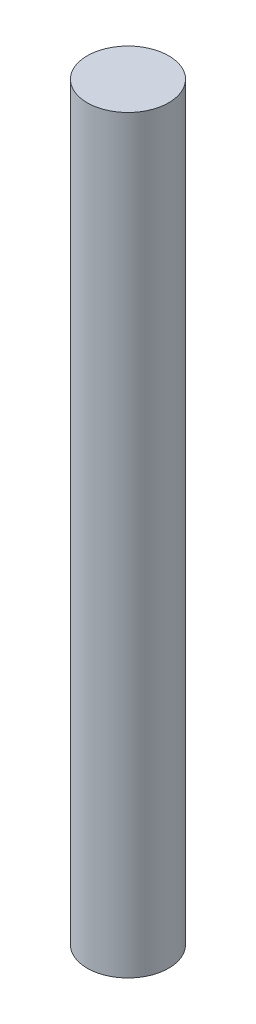
ISO-10303-21;
HEADER;
FILE_DESCRIPTION(('STEP AP214'),'2;1');
FILE_NAME('part.step','',(''),(''),'','','');
FILE_SCHEMA(('AUTOMOTIVE_DESIGN { 1 0 10303 214 1 1 1 1 }'));
ENDSEC;
DATA;
#1=APPLICATION_CONTEXT('core data for automotive mechanical design processes');
#2=APPLICATION_PROTOCOL_DEFINITION('international standard','automotive_design',2000,#1);
#3=PRODUCT_CONTEXT('',#1,'mechanical');
#4=PRODUCT('Part','Part','',(#3));
#5=PRODUCT_RELATED_PRODUCT_CATEGORY('part','',(#4));
#6=PRODUCT_DEFINITION_FORMATION('','',#4);
#7=PRODUCT_DEFINITION_CONTEXT('part definition',#1,'design');
#8=PRODUCT_DEFINITION('design','',#6,#7);
#9=PRODUCT_DEFINITION_SHAPE('','',#8);
#10=(LENGTH_UNIT() NAMED_UNIT(*) SI_UNIT(.MILLI.,.METRE.));
#11=(NAMED_UNIT(*) PLANE_ANGLE_UNIT() SI_UNIT($,.RADIAN.));
#12=(NAMED_UNIT(*) SI_UNIT($,.STERADIAN.) SOLID_ANGLE_UNIT());
#13=UNCERTAINTY_MEASURE_WITH_UNIT(LENGTH_MEASURE(1.E-05),#10,'distance_accuracy_value','');
#14=(GEOMETRIC_REPRESENTATION_CONTEXT(3) GLOBAL_UNCERTAINTY_ASSIGNED_CONTEXT((#13)) GLOBAL_UNIT_ASSIGNED_CONTEXT((#10,
#11,#12)) REPRESENTATION_CONTEXT('',''));
#15=CARTESIAN_POINT('',(0.,0.,0.));
#16=DIRECTION('',(0.,0.,1.));
#17=DIRECTION('',(1.,0.,0.));
#18=AXIS2_PLACEMENT_3D('',#15,#16,#17);
#19=CARTESIAN_POINT('',(0.,46.,0.));
#20=DIRECTION('',(0.,-1.,0.));
#21=DIRECTION('',(0.,0.,-1.));
#22=AXIS2_PLACEMENT_3D('',#19,#20,#21);
#23=CYLINDRICAL_SURFACE('',#22,2.5);
#24=CARTESIAN_POINT('',(0.,46.,0.));
#25=DIRECTION('',(0.,1.,0.));
#26=DIRECTION('',(0.,0.,1.));
#27=AXIS2_PLACEMENT_3D('',#24,#25,#26);
#28=CIRCLE('',#27,2.5);
#29=CARTESIAN_POINT('',(0.,46.,2.5));
#30=VERTEX_POINT('',#29);
#31=EDGE_CURVE('E10',#30,#30,#28,.T.);
#32=ORIENTED_EDGE('',*,*,#31,.F.);
#33=EDGE_LOOP('',(#32));
#34=FACE_BOUND('',#33,.T.);
#35=CARTESIAN_POINT('',(0.,0.,0.));
#36=DIRECTION('',(0.,1.,0.));
#37=DIRECTION('',(0.,0.,1.));
#38=AXIS2_PLACEMENT_3D('',#35,#36,#37);
#39=CIRCLE('',#38,2.5);
#40=CARTESIAN_POINT('',(0.,0.,2.5));
#41=VERTEX_POINT('',#40);
#42=EDGE_CURVE('E40',#41,#41,#39,.T.);
#43=ORIENTED_EDGE('',*,*,#42,.T.);
#44=EDGE_LOOP('',(#43));
#45=FACE_BOUND('',#44,.T.);
#46=ADVANCED_FACE('F37',(#34,#45),#23,.T.);
#47=CARTESIAN_POINT('',(0.,46.,0.));
#48=DIRECTION('',(0.,1.,0.));
#49=DIRECTION('',(0.,0.,1.));
#50=AXIS2_PLACEMENT_3D('',#47,#48,#49);
#51=PLANE('',#50);
#52=ORIENTED_EDGE('',*,*,#31,.T.);
#53=EDGE_LOOP('',(#52));
#54=FACE_BOUND('',#53,.T.);
#55=ADVANCED_FACE('F54',(#54),#51,.T.);
#56=CARTESIAN_POINT('',(0.,0.,0.));
#57=DIRECTION('',(0.,1.,0.));
#58=DIRECTION('',(0.,0.,1.));
#59=AXIS2_PLACEMENT_3D('',#56,#57,#58);
#60=PLANE('',#59);
#61=ORIENTED_EDGE('',*,*,#42,.F.);
#62=EDGE_LOOP('',(#61));
#63=FACE_BOUND('',#62,.T.);
#64=ADVANCED_FACE('F52',(#63),#60,.F.);
#65=CLOSED_SHELL('',(#46,#55,#64));
#66=MANIFOLD_SOLID_BREP('B2',#65);
#67=ADVANCED_BREP_SHAPE_REPRESENTATION('',(#18,#66),#14);
#68=SHAPE_DEFINITION_REPRESENTATION(#9,#67);
ENDSEC;
END-ISO-10303-21;
